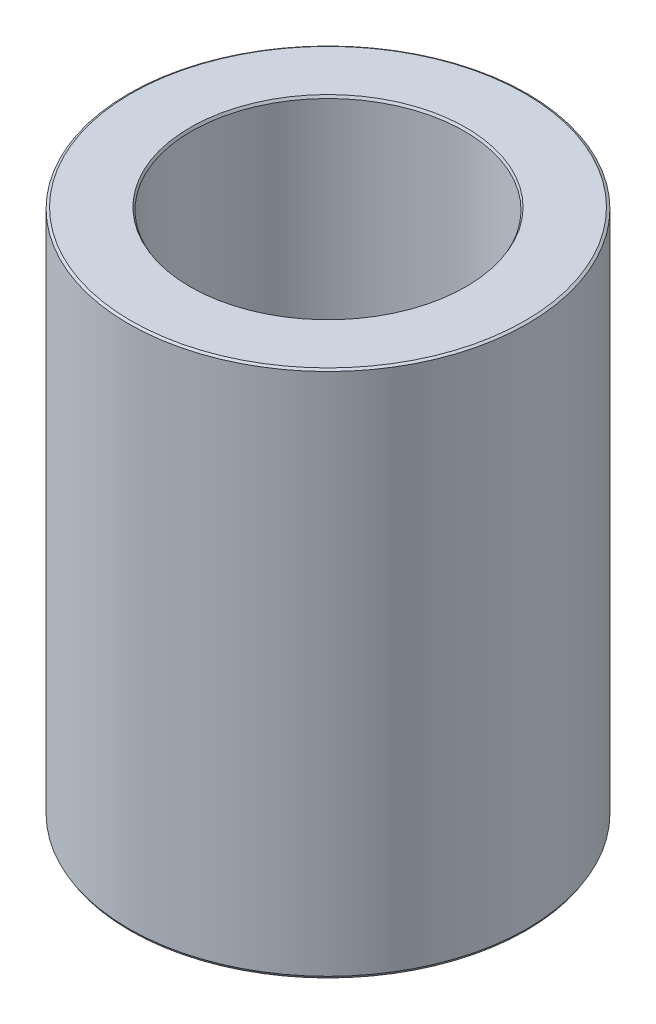
ISO-10303-21;
HEADER;
FILE_DESCRIPTION(('STEP AP214'),'2;1');
FILE_NAME('part.step','',(''),(''),'','','');
FILE_SCHEMA(('AUTOMOTIVE_DESIGN { 1 0 10303 214 1 1 1 1 }'));
ENDSEC;
DATA;
#1=APPLICATION_CONTEXT('core data for automotive mechanical design processes');
#2=APPLICATION_PROTOCOL_DEFINITION('international standard','automotive_design',2000,#1);
#3=PRODUCT_CONTEXT('',#1,'mechanical');
#4=PRODUCT('Part','Part','',(#3));
#5=PRODUCT_RELATED_PRODUCT_CATEGORY('part','',(#4));
#6=PRODUCT_DEFINITION_FORMATION('','',#4);
#7=PRODUCT_DEFINITION_CONTEXT('part definition',#1,'design');
#8=PRODUCT_DEFINITION('design','',#6,#7);
#9=PRODUCT_DEFINITION_SHAPE('','',#8);
#10=(LENGTH_UNIT() NAMED_UNIT(*) SI_UNIT(.MILLI.,.METRE.));
#11=(NAMED_UNIT(*) PLANE_ANGLE_UNIT() SI_UNIT($,.RADIAN.));
#12=(NAMED_UNIT(*) SI_UNIT($,.STERADIAN.) SOLID_ANGLE_UNIT());
#13=UNCERTAINTY_MEASURE_WITH_UNIT(LENGTH_MEASURE(1.E-05),#10,'distance_accuracy_value','');
#14=(GEOMETRIC_REPRESENTATION_CONTEXT(3) GLOBAL_UNCERTAINTY_ASSIGNED_CONTEXT((#13)) GLOBAL_UNIT_ASSIGNED_CONTEXT((#10,
#11,#12)) REPRESENTATION_CONTEXT('',''));
#15=CARTESIAN_POINT('',(0.,0.,0.));
#16=DIRECTION('',(0.,0.,1.));
#17=DIRECTION('',(1.,0.,0.));
#18=AXIS2_PLACEMENT_3D('',#15,#16,#17);
#19=CARTESIAN_POINT('',(0.,86.0115037836632,0.));
#20=DIRECTION('',(0.,-1.,0.));
#21=DIRECTION('',(0.,0.,-1.));
#22=AXIS2_PLACEMENT_3D('',#19,#20,#21);
#23=CYLINDRICAL_SURFACE('',#22,32.5);
#24=CARTESIAN_POINT('',(0.,0.396947342733142,0.));
#25=DIRECTION('',(0.,1.,0.));
#26=DIRECTION('',(0.,0.,1.));
#27=AXIS2_PLACEMENT_3D('',#24,#25,#26);
#28=CIRCLE('',#27,32.5);
#29=CARTESIAN_POINT('',(0.,0.396947342733142,32.5));
#30=VERTEX_POINT('',#29);
#31=EDGE_CURVE('E10',#30,#30,#28,.T.);
#32=ORIENTED_EDGE('',*,*,#31,.T.);
#33=EDGE_LOOP('',(#32));
#34=FACE_BOUND('',#33,.T.);
#35=CARTESIAN_POINT('',(0.,85.7823261284821,0.));
#36=DIRECTION('',(0.,1.,0.));
#37=DIRECTION('',(0.,0.,1.));
#38=AXIS2_PLACEMENT_3D('',#35,#36,#37);
#39=CIRCLE('',#38,32.5);
#40=CARTESIAN_POINT('',(0.,85.7823261284821,32.5));
#41=VERTEX_POINT('',#40);
#42=EDGE_CURVE('E50',#41,#41,#39,.F.);
#43=ORIENTED_EDGE('',*,*,#42,.T.);
#44=EDGE_LOOP('',(#43));
#45=FACE_BOUND('',#44,.T.);
#46=ADVANCED_FACE('F39',(#34,#45),#23,.T.);
#47=CARTESIAN_POINT('',(0.,86.0115037836632,0.));
#48=DIRECTION('',(0.,1.,0.));
#49=DIRECTION('',(0.,0.,1.));
#50=AXIS2_PLACEMENT_3D('',#47,#48,#49);
#51=PLANE('',#50);
#52=CARTESIAN_POINT('',(0.,86.0115037836632,0.));
#53=DIRECTION('',(0.,1.,0.));
#54=DIRECTION('',(0.,0.,1.));
#55=AXIS2_PLACEMENT_3D('',#52,#53,#54);
#56=CIRCLE('',#55,22.4856869337932);
#57=CARTESIAN_POINT('',(0.,86.0115037836632,22.4856869337932));
#58=VERTEX_POINT('',#57);
#59=EDGE_CURVE('E58',#58,#58,#56,.F.);
#60=ORIENTED_EDGE('',*,*,#59,.T.);
#61=EDGE_LOOP('',(#60));
#62=FACE_BOUND('',#61,.T.);
#63=CARTESIAN_POINT('',(0.,86.0115037836632,0.));
#64=DIRECTION('',(0.,1.,0.));
#65=DIRECTION('',(0.,0.,1.));
#66=AXIS2_PLACEMENT_3D('',#63,#64,#65);
#67=CIRCLE('',#66,32.1030526572668);
#68=CARTESIAN_POINT('',(0.,86.0115037836632,32.1030526572668));
#69=VERTEX_POINT('',#68);
#70=EDGE_CURVE('E61',#69,#69,#67,.T.);
#71=ORIENTED_EDGE('',*,*,#70,.T.);
#72=EDGE_LOOP('',(#71));
#73=FACE_BOUND('',#72,.T.);
#74=ADVANCED_FACE('F88',(#62,#73),#51,.T.);
#75=CARTESIAN_POINT('',(0.,0.,0.));
#76=DIRECTION('',(0.,1.,0.));
#77=DIRECTION('',(0.,0.,1.));
#78=AXIS2_PLACEMENT_3D('',#75,#76,#77);
#79=PLANE('',#78);
#80=CARTESIAN_POINT('',(0.,0.,0.));
#81=DIRECTION('',(0.,1.,0.));
#82=DIRECTION('',(0.,0.,1.));
#83=AXIS2_PLACEMENT_3D('',#80,#81,#82);
#84=CIRCLE('',#83,22.6534566213453);
#85=CARTESIAN_POINT('',(0.,0.,22.6534566213453));
#86=VERTEX_POINT('',#85);
#87=EDGE_CURVE('E51',#86,#86,#84,.T.);
#88=ORIENTED_EDGE('',*,*,#87,.T.);
#89=EDGE_LOOP('',(#88));
#90=FACE_BOUND('',#89,.T.);
#91=CARTESIAN_POINT('',(0.,0.,0.));
#92=DIRECTION('',(0.,1.,0.));
#93=DIRECTION('',(0.,0.,1.));
#94=AXIS2_PLACEMENT_3D('',#91,#92,#93);
#95=CIRCLE('',#94,32.2708223448189);
#96=CARTESIAN_POINT('',(0.,0.,32.2708223448189));
#97=VERTEX_POINT('',#96);
#98=EDGE_CURVE('E54',#97,#97,#95,.F.);
#99=ORIENTED_EDGE('',*,*,#98,.T.);
#100=EDGE_LOOP('',(#99));
#101=FACE_BOUND('',#100,.T.);
#102=ADVANCED_FACE('F83',(#90,#101),#79,.F.);
#103=CARTESIAN_POINT('',(0.,86.0115037836632,0.));
#104=DIRECTION('',(0.,-1.,0.));
#105=DIRECTION('',(0.,0.,-1.));
#106=AXIS2_PLACEMENT_3D('',#103,#104,#105);
#107=CYLINDRICAL_SURFACE('',#106,22.2565092786121);
#108=CARTESIAN_POINT('',(0.,85.61455644093,0.));
#109=DIRECTION('',(0.,1.,0.));
#110=DIRECTION('',(0.,0.,1.));
#111=AXIS2_PLACEMENT_3D('',#108,#109,#110);
#112=CIRCLE('',#111,22.2565092786121);
#113=CARTESIAN_POINT('',(0.,85.61455644093,22.2565092786121));
#114=VERTEX_POINT('',#113);
#115=EDGE_CURVE('E67',#114,#114,#112,.T.);
#116=ORIENTED_EDGE('',*,*,#115,.T.);
#117=EDGE_LOOP('',(#116));
#118=FACE_BOUND('',#117,.T.);
#119=CARTESIAN_POINT('',(0.,0.229177655181101,0.));
#120=DIRECTION('',(0.,1.,0.));
#121=DIRECTION('',(0.,0.,1.));
#122=AXIS2_PLACEMENT_3D('',#119,#120,#121);
#123=CIRCLE('',#122,22.2565092786121);
#124=CARTESIAN_POINT('',(0.,0.229177655181101,22.2565092786121));
#125=VERTEX_POINT('',#124);
#126=EDGE_CURVE('E69',#125,#125,#123,.F.);
#127=ORIENTED_EDGE('',*,*,#126,.T.);
#128=EDGE_LOOP('',(#127));
#129=FACE_BOUND('',#128,.T.);
#130=ADVANCED_FACE('F71',(#118,#129),#107,.F.);
#131=CARTESIAN_POINT('',(0.,85.61455644093,0.));
#132=DIRECTION('',(0.,1.,0.));
#133=DIRECTION('',(0.,0.,1.));
#134=AXIS2_PLACEMENT_3D('',#131,#132,#133);
#135=CONICAL_SURFACE('',#134,22.2565092786121,0.523598775598279);
#136=CARTESIAN_POINT('',(0.,86.0115037836632,22.4856869337932));
#137=CARTESIAN_POINT('',(0.,86.0073689155097,22.4832996665517));
#138=CARTESIAN_POINT('',(0.,86.0032340473562,22.4809123993102));
#139=CARTESIAN_POINT('',(0.,85.9949643110493,22.4761378648273));
#140=CARTESIAN_POINT('',(0.,85.9908294428958,22.4737505975858));
#141=CARTESIAN_POINT('',(0.,85.9825597065889,22.4689760631029));
#142=CARTESIAN_POINT('',(0.,85.9784248384354,22.4665887958614));
#143=CARTESIAN_POINT('',(0.,85.9701551021285,22.4618142613785));
#144=CARTESIAN_POINT('',(0.,85.966020233975,22.459426994137));
#145=CARTESIAN_POINT('',(0.,85.9577504976681,22.4546524596541));
#146=CARTESIAN_POINT('',(0.,85.9536156295146,22.4522651924126));
#147=CARTESIAN_POINT('',(0.,85.9453458932077,22.4474906579297));
#148=CARTESIAN_POINT('',(0.,85.9412110250542,22.4451033906882));
#149=CARTESIAN_POINT('',(0.,85.9329412887472,22.4403288562053));
#150=CARTESIAN_POINT('',(0.,85.9288064205938,22.4379415889638));
#151=CARTESIAN_POINT('',(0.,85.9205366842868,22.4331670544808));
#152=CARTESIAN_POINT('',(0.,85.9164018161334,22.4307797872394));
#153=CARTESIAN_POINT('',(0.,85.9081320798264,22.4260052527564));
#154=CARTESIAN_POINT('',(0.,85.903997211673,22.423617985515));
#155=CARTESIAN_POINT('',(0.,85.895727475366,22.418843451032));
#156=CARTESIAN_POINT('',(0.,85.8915926072125,22.4164561837906));
#157=CARTESIAN_POINT('',(0.,85.8833228709056,22.4116816493076));
#158=CARTESIAN_POINT('',(0.,85.8791880027521,22.4092943820662));
#159=CARTESIAN_POINT('',(0.,85.8709182664452,22.4045198475832));
#160=CARTESIAN_POINT('',(0.,85.8667833982917,22.4021325803417));
#161=CARTESIAN_POINT('',(0.,85.8585136619848,22.3973580458588));
#162=CARTESIAN_POINT('',(0.,85.8543787938313,22.3949707786173));
#163=CARTESIAN_POINT('',(0.,85.8461090575244,22.3901962441344));
#164=CARTESIAN_POINT('',(0.,85.8419741893709,22.3878089768929));
#165=CARTESIAN_POINT('',(0.,85.833704453064,22.38303444241));
#166=CARTESIAN_POINT('',(0.,85.8295695849105,22.3806471751685));
#167=CARTESIAN_POINT('',(0.,85.8212998486036,22.3758726406856));
#168=CARTESIAN_POINT('',(0.,85.8171649804501,22.3734853734441));
#169=CARTESIAN_POINT('',(0.,85.8088952441431,22.3687108389612));
#170=CARTESIAN_POINT('',(0.,85.8047603759897,22.3663235717197));
#171=CARTESIAN_POINT('',(0.,85.7964906396827,22.3615490372368));
#172=CARTESIAN_POINT('',(0.,85.7923557715293,22.3591617699953));
#173=CARTESIAN_POINT('',(0.,85.7840860352223,22.3543872355124));
#174=CARTESIAN_POINT('',(0.,85.7799511670688,22.3519999682709));
#175=CARTESIAN_POINT('',(0.,85.7716814307619,22.3472254337879));
#176=CARTESIAN_POINT('',(0.,85.7675465626084,22.3448381665465));
#177=CARTESIAN_POINT('',(0.,85.7592768263015,22.3400636320635));
#178=CARTESIAN_POINT('',(0.,85.755141958148,22.3376763648221));
#179=CARTESIAN_POINT('',(0.,85.7468722218411,22.3329018303391));
#180=CARTESIAN_POINT('',(0.,85.7427373536876,22.3305145630977));
#181=CARTESIAN_POINT('',(0.,85.7344676173807,22.3257400286147));
#182=CARTESIAN_POINT('',(0.,85.7303327492272,22.3233527613732));
#183=CARTESIAN_POINT('',(0.,85.7220630129203,22.3185782268903));
#184=CARTESIAN_POINT('',(0.,85.7179281447668,22.3161909596488));
#185=CARTESIAN_POINT('',(0.,85.7096584084598,22.3114164251659));
#186=CARTESIAN_POINT('',(0.,85.7055235403064,22.3090291579244));
#187=CARTESIAN_POINT('',(0.,85.6972538039994,22.3042546234415));
#188=CARTESIAN_POINT('',(0.,85.693118935846,22.3018673562));
#189=CARTESIAN_POINT('',(0.,85.684849199539,22.2970928217171));
#190=CARTESIAN_POINT('',(0.,85.6807143313855,22.2947055544756));
#191=CARTESIAN_POINT('',(0.,85.6724445950786,22.2899310199927));
#192=CARTESIAN_POINT('',(0.,85.6683097269251,22.2875437527512));
#193=CARTESIAN_POINT('',(0.,85.6600399906182,22.2827692182683));
#194=CARTESIAN_POINT('',(0.,85.6559051224647,22.2803819510268));
#195=CARTESIAN_POINT('',(0.,85.6476353861578,22.2756074165439));
#196=CARTESIAN_POINT('',(0.,85.6435005180043,22.2732201493024));
#197=CARTESIAN_POINT('',(0.,85.6352307816974,22.2684456148194));
#198=CARTESIAN_POINT('',(0.,85.6310959135439,22.266058347578));
#199=CARTESIAN_POINT('',(0.,85.622826177237,22.261283813095));
#200=CARTESIAN_POINT('',(0.,85.6186913090835,22.2588965458536));
#201=CARTESIAN_POINT('',(0.,85.61455644093,22.2565092786121));
#202=B_SPLINE_CURVE_WITH_KNOTS('',3,(#136,#137,#138,#139,#140,#141,#142,#143,#144,#145,#146,
#147,#148,#149,#150,#151,#152,#153,#154,#155,#156,#157,#158,#159,#160,#161,#162,#163,#164,#165,
#166,#167,#168,#169,#170,#171,#172,#173,#174,#175,#176,#177,#178,#179,#180,#181,#182,#183,#184,
#185,#186,#187,#188,#189,#190,#191,#192,#193,#194,#195,#196,#197,#198,#199,#200,#201),
.UNSPECIFIED.,.F.,.F.,(4,2,2,2,2,2,2,2,2,2,2,2,2,2,2,2,2,2,2,2,2,2,2,2,2,2,2,2,2,2,2,2,4),(0.,
0.0143236034488251,0.02864720689764,0.0429708103464651,0.05729441379528,0.0716180172440931,
0.0859416206929182,0.100265224141733,0.114588827590546,0.128912431039371,0.143236034488186,
0.157559637937011,0.171883241385824,0.186206844834639,0.200530448283464,0.214854051732278,
0.229177655181092,0.243501258629918,0.257824862078731,0.272148465527558,0.286472068976371,
0.300795672425184,0.315119275874011,0.329442879322824,0.343766482771649,0.358090086220464,
0.372413689669277,0.386737293118102,0.401060896566917,0.41538450001573,0.429708103464555,
0.44403170691337,0.458355310362183),.UNSPECIFIED.);
#203=EDGE_CURVE('BSEAM77',#58,#114,#202,.T.);
#204=ORIENTED_EDGE('',*,*,#59,.F.);
#205=ORIENTED_EDGE('',*,*,#115,.F.);
#206=ORIENTED_EDGE('',*,*,#203,.T.);
#207=ORIENTED_EDGE('',*,*,#203,.F.);
#208=EDGE_LOOP('',(#204,#206,#205,#207));
#209=FACE_BOUND('',#208,.T.);
#210=ADVANCED_FACE('F77',(#209),#135,.F.);
#211=CARTESIAN_POINT('',(0.,0.,0.));
#212=DIRECTION('',(0.,-1.,0.));
#213=DIRECTION('',(0.,0.,-1.));
#214=AXIS2_PLACEMENT_3D('',#211,#212,#213);
#215=CONICAL_SURFACE('',#214,22.6534566213453,1.04719755119663);
#216=ORIENTED_EDGE('',*,*,#126,.F.);
#217=EDGE_LOOP('',(#216));
#218=FACE_BOUND('',#217,.T.);
#219=ORIENTED_EDGE('',*,*,#87,.F.);
#220=EDGE_LOOP('',(#219));
#221=FACE_BOUND('',#220,.T.);
#222=ADVANCED_FACE('F73',(#218,#221),#215,.F.);
#223=CARTESIAN_POINT('',(0.,0.396947342733142,0.));
#224=DIRECTION('',(0.,1.,0.));
#225=DIRECTION('',(0.,0.,1.));
#226=AXIS2_PLACEMENT_3D('',#223,#224,#225);
#227=CONICAL_SURFACE('',#226,32.5,0.5235987755983);
#228=ORIENTED_EDGE('',*,*,#98,.F.);
#229=EDGE_LOOP('',(#228));
#230=FACE_BOUND('',#229,.T.);
#231=ORIENTED_EDGE('',*,*,#31,.F.);
#232=EDGE_LOOP('',(#231));
#233=FACE_BOUND('',#232,.T.);
#234=ADVANCED_FACE('F76',(#230,#233),#227,.T.);
#235=CARTESIAN_POINT('',(0.,86.0115037836632,0.));
#236=DIRECTION('',(0.,-1.,0.));
#237=DIRECTION('',(0.,0.,-1.));
#238=AXIS2_PLACEMENT_3D('',#235,#236,#237);
#239=CONICAL_SURFACE('',#238,32.1030526572668,1.04719755119659);
#240=ORIENTED_EDGE('',*,*,#42,.F.);
#241=EDGE_LOOP('',(#240));
#242=FACE_BOUND('',#241,.T.);
#243=ORIENTED_EDGE('',*,*,#70,.F.);
#244=EDGE_LOOP('',(#243));
#245=FACE_BOUND('',#244,.T.);
#246=ADVANCED_FACE('F45',(#242,#245),#239,.T.);
#247=CLOSED_SHELL('',(#46,#74,#102,#130,#210,#222,#234,#246));
#248=MANIFOLD_SOLID_BREP('B2',#247);
#249=ADVANCED_BREP_SHAPE_REPRESENTATION('',(#18,#248),#14);
#250=SHAPE_DEFINITION_REPRESENTATION(#9,#249);
ENDSEC;
END-ISO-10303-21;
